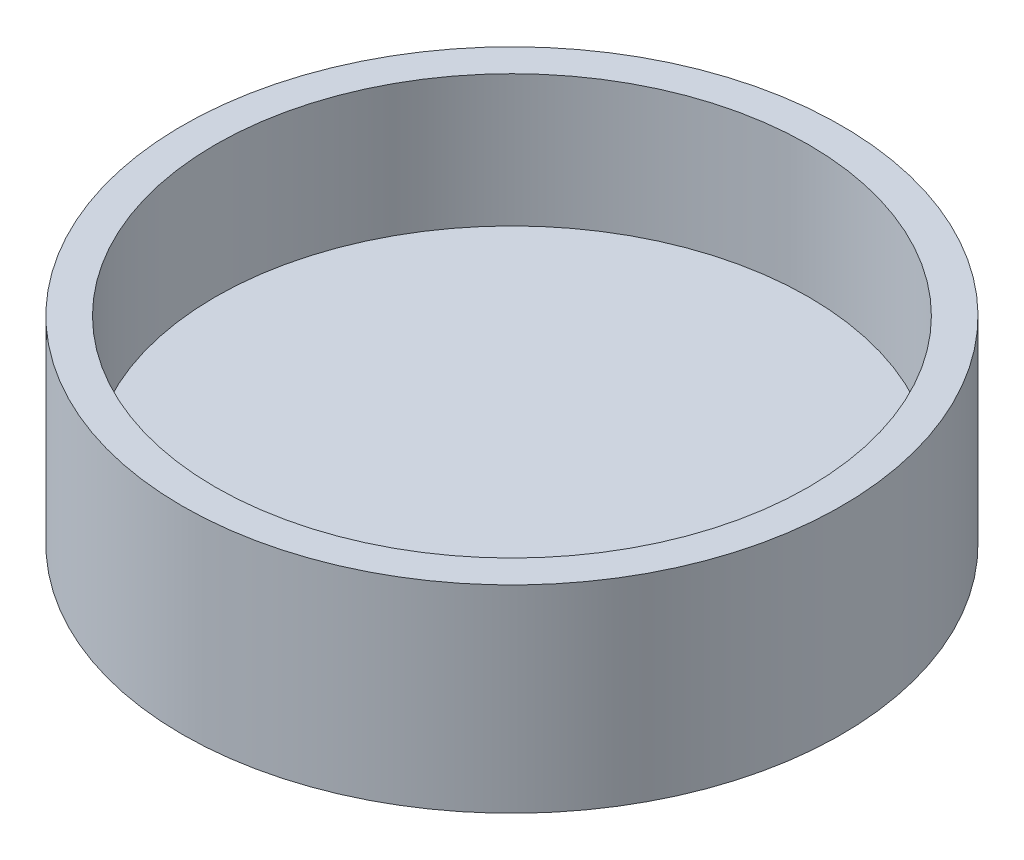
ISO-10303-21;
HEADER;
FILE_DESCRIPTION(('STEP AP214'),'2;1');
FILE_NAME('part.step','',(''),(''),'','','');
FILE_SCHEMA(('AUTOMOTIVE_DESIGN { 1 0 10303 214 1 1 1 1 }'));
ENDSEC;
DATA;
#1=APPLICATION_CONTEXT('core data for automotive mechanical design processes');
#2=APPLICATION_PROTOCOL_DEFINITION('international standard','automotive_design',2000,#1);
#3=PRODUCT_CONTEXT('',#1,'mechanical');
#4=PRODUCT('Part','Part','',(#3));
#5=PRODUCT_RELATED_PRODUCT_CATEGORY('part','',(#4));
#6=PRODUCT_DEFINITION_FORMATION('','',#4);
#7=PRODUCT_DEFINITION_CONTEXT('part definition',#1,'design');
#8=PRODUCT_DEFINITION('design','',#6,#7);
#9=PRODUCT_DEFINITION_SHAPE('','',#8);
#10=(LENGTH_UNIT() NAMED_UNIT(*) SI_UNIT(.MILLI.,.METRE.));
#11=(NAMED_UNIT(*) PLANE_ANGLE_UNIT() SI_UNIT($,.RADIAN.));
#12=(NAMED_UNIT(*) SI_UNIT($,.STERADIAN.) SOLID_ANGLE_UNIT());
#13=UNCERTAINTY_MEASURE_WITH_UNIT(LENGTH_MEASURE(1.E-05),#10,'distance_accuracy_value','');
#14=(GEOMETRIC_REPRESENTATION_CONTEXT(3) GLOBAL_UNCERTAINTY_ASSIGNED_CONTEXT((#13)) GLOBAL_UNIT_ASSIGNED_CONTEXT((#10,
#11,#12)) REPRESENTATION_CONTEXT('',''));
#15=CARTESIAN_POINT('',(0.,0.,0.));
#16=DIRECTION('',(0.,0.,1.));
#17=DIRECTION('',(1.,0.,0.));
#18=AXIS2_PLACEMENT_3D('',#15,#16,#17);
#19=CARTESIAN_POINT('',(0.,10.,0.));
#20=DIRECTION('',(0.,-1.,0.));
#21=DIRECTION('',(0.,0.,-1.));
#22=AXIS2_PLACEMENT_3D('',#19,#20,#21);
#23=CYLINDRICAL_SURFACE('',#22,50.);
#24=CARTESIAN_POINT('',(0.,0.,0.));
#25=DIRECTION('',(0.,1.,0.));
#26=DIRECTION('',(0.,0.,1.));
#27=AXIS2_PLACEMENT_3D('',#24,#25,#26);
#28=CIRCLE('',#27,50.);
#29=CARTESIAN_POINT('',(0.,0.,50.));
#30=VERTEX_POINT('',#29);
#31=EDGE_CURVE('E44',#30,#30,#28,.T.);
#32=ORIENTED_EDGE('',*,*,#31,.T.);
#33=EDGE_LOOP('',(#32));
#34=FACE_BOUND('',#33,.T.);
#35=CARTESIAN_POINT('',(0.,30.,0.));
#36=DIRECTION('',(0.,1.,0.));
#37=DIRECTION('',(0.,0.,1.));
#38=AXIS2_PLACEMENT_3D('',#35,#36,#37);
#39=CIRCLE('',#38,50.);
#40=CARTESIAN_POINT('',(0.,30.,50.));
#41=VERTEX_POINT('',#40);
#42=EDGE_CURVE('E49',#41,#41,#39,.T.);
#43=ORIENTED_EDGE('',*,*,#42,.F.);
#44=EDGE_LOOP('',(#43));
#45=FACE_BOUND('',#44,.T.);
#46=ADVANCED_FACE('F37',(#34,#45),#23,.T.);
#47=CARTESIAN_POINT('',(0.,0.,0.));
#48=DIRECTION('',(0.,1.,0.));
#49=DIRECTION('',(0.,0.,1.));
#50=AXIS2_PLACEMENT_3D('',#47,#48,#49);
#51=PLANE('',#50);
#52=ORIENTED_EDGE('',*,*,#31,.F.);
#53=EDGE_LOOP('',(#52));
#54=FACE_BOUND('',#53,.T.);
#55=ADVANCED_FACE('F65',(#54),#51,.F.);
#56=CARTESIAN_POINT('',(0.,30.,0.));
#57=DIRECTION('',(0.,1.,0.));
#58=DIRECTION('',(0.,0.,1.));
#59=AXIS2_PLACEMENT_3D('',#56,#57,#58);
#60=PLANE('',#59);
#61=ORIENTED_EDGE('',*,*,#42,.T.);
#62=EDGE_LOOP('',(#61));
#63=FACE_BOUND('',#62,.T.);
#64=CARTESIAN_POINT('',(0.,30.,0.));
#65=DIRECTION('',(0.,1.,0.));
#66=DIRECTION('',(0.,0.,1.));
#67=AXIS2_PLACEMENT_3D('',#64,#65,#66);
#68=CIRCLE('',#67,45.);
#69=CARTESIAN_POINT('',(0.,30.,45.));
#70=VERTEX_POINT('',#69);
#71=EDGE_CURVE('E54',#70,#70,#68,.T.);
#72=ORIENTED_EDGE('',*,*,#71,.F.);
#73=EDGE_LOOP('',(#72));
#74=FACE_BOUND('',#73,.T.);
#75=ADVANCED_FACE('F63',(#63,#74),#60,.T.);
#76=CARTESIAN_POINT('',(0.,30.,0.));
#77=DIRECTION('',(0.,-1.,0.));
#78=DIRECTION('',(0.,0.,-1.));
#79=AXIS2_PLACEMENT_3D('',#76,#77,#78);
#80=CYLINDRICAL_SURFACE('',#79,45.);
#81=ORIENTED_EDGE('',*,*,#71,.T.);
#82=EDGE_LOOP('',(#81));
#83=FACE_BOUND('',#82,.T.);
#84=CARTESIAN_POINT('',(0.,10.,0.));
#85=DIRECTION('',(0.,1.,0.));
#86=DIRECTION('',(0.,0.,1.));
#87=AXIS2_PLACEMENT_3D('',#84,#85,#86);
#88=CIRCLE('',#87,45.);
#89=CARTESIAN_POINT('',(0.,10.,45.));
#90=VERTEX_POINT('',#89);
#91=EDGE_CURVE('E10',#90,#90,#88,.F.);
#92=ORIENTED_EDGE('',*,*,#91,.T.);
#93=EDGE_LOOP('',(#92));
#94=FACE_BOUND('',#93,.T.);
#95=ADVANCED_FACE('F61',(#83,#94),#80,.F.);
#96=CARTESIAN_POINT('',(0.,10.,0.));
#97=DIRECTION('',(0.,1.,0.));
#98=DIRECTION('',(0.,0.,1.));
#99=AXIS2_PLACEMENT_3D('',#96,#97,#98);
#100=PLANE('',#99);
#101=ORIENTED_EDGE('',*,*,#91,.F.);
#102=EDGE_LOOP('',(#101));
#103=FACE_BOUND('',#102,.T.);
#104=ADVANCED_FACE('F72',(#103),#100,.T.);
#105=CLOSED_SHELL('',(#46,#55,#75,#95,#104));
#106=MANIFOLD_SOLID_BREP('B2',#105);
#107=ADVANCED_BREP_SHAPE_REPRESENTATION('',(#18,#106),#14);
#108=SHAPE_DEFINITION_REPRESENTATION(#9,#107);
ENDSEC;
END-ISO-10303-21;
